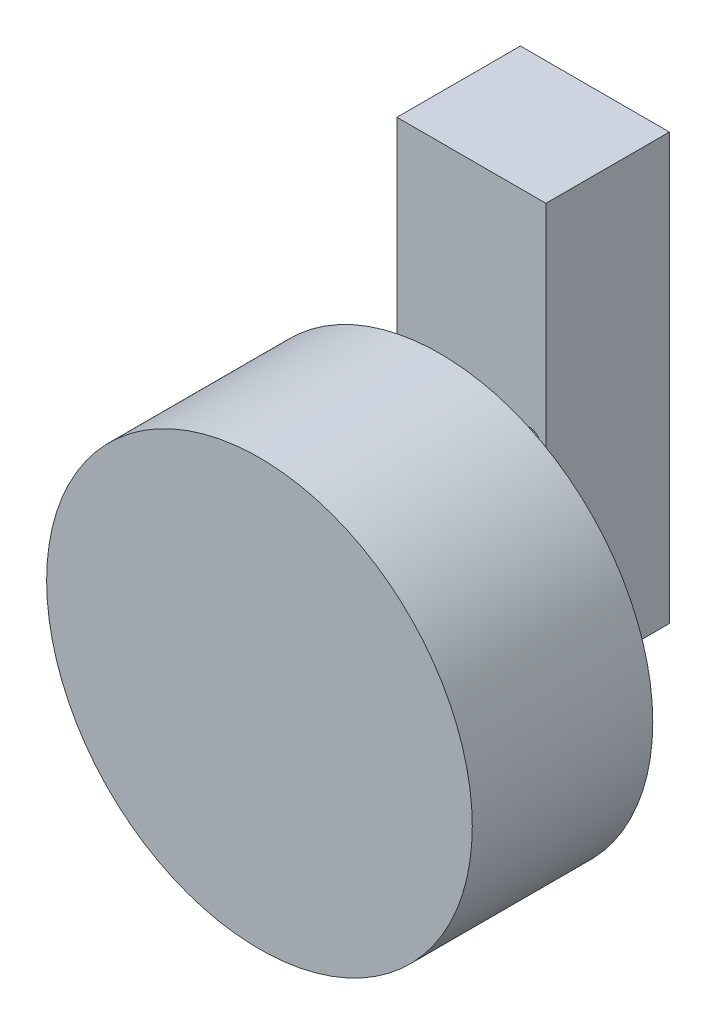
ISO-10303-21;
HEADER;
FILE_DESCRIPTION(('STEP AP214'),'2;1');
FILE_NAME('part.step','',(''),(''),'','','');
FILE_SCHEMA(('AUTOMOTIVE_DESIGN { 1 0 10303 214 1 1 1 1 }'));
ENDSEC;
DATA;
#1=APPLICATION_CONTEXT('core data for automotive mechanical design processes');
#2=APPLICATION_PROTOCOL_DEFINITION('international standard','automotive_design',2000,#1);
#3=PRODUCT_CONTEXT('',#1,'mechanical');
#4=PRODUCT('Part','Part','',(#3));
#5=PRODUCT_RELATED_PRODUCT_CATEGORY('part','',(#4));
#6=PRODUCT_DEFINITION_FORMATION('','',#4);
#7=PRODUCT_DEFINITION_CONTEXT('part definition',#1,'design');
#8=PRODUCT_DEFINITION('design','',#6,#7);
#9=PRODUCT_DEFINITION_SHAPE('','',#8);
#10=(LENGTH_UNIT() NAMED_UNIT(*) SI_UNIT(.MILLI.,.METRE.));
#11=(NAMED_UNIT(*) PLANE_ANGLE_UNIT() SI_UNIT($,.RADIAN.));
#12=(NAMED_UNIT(*) SI_UNIT($,.STERADIAN.) SOLID_ANGLE_UNIT());
#13=UNCERTAINTY_MEASURE_WITH_UNIT(LENGTH_MEASURE(1.E-05),#10,'distance_accuracy_value','');
#14=(GEOMETRIC_REPRESENTATION_CONTEXT(3) GLOBAL_UNCERTAINTY_ASSIGNED_CONTEXT((#13)) GLOBAL_UNIT_ASSIGNED_CONTEXT((#10,
#11,#12)) REPRESENTATION_CONTEXT('',''));
#15=CARTESIAN_POINT('',(0.,0.,0.));
#16=DIRECTION('',(0.,0.,1.));
#17=DIRECTION('',(1.,0.,0.));
#18=AXIS2_PLACEMENT_3D('',#15,#16,#17);
#19=CARTESIAN_POINT('',(0.,0.,18.415));
#20=DIRECTION('',(0.,0.,1.));
#21=DIRECTION('',(1.,0.,0.));
#22=AXIS2_PLACEMENT_3D('',#19,#20,#21);
#23=PLANE('',#22);
#24=CARTESIAN_POINT('',(-12.9695884476535,0.687725631768964,18.415));
#25=DIRECTION('',(0.,0.,1.));
#26=DIRECTION('',(1.,0.,0.));
#27=AXIS2_PLACEMENT_3D('',#24,#25,#26);
#28=CIRCLE('',#27,1.5875);
#29=CARTESIAN_POINT('',(-11.3820884476535,0.687725631768964,18.415));
#30=VERTEX_POINT('',#29);
#31=EDGE_CURVE('E115',#30,#30,#28,.T.);
#32=ORIENTED_EDGE('',*,*,#31,.F.);
#33=EDGE_LOOP('',(#32));
#34=FACE_BOUND('',#33,.T.);
#35=DIRECTION('',(0.,-1.,0.));
#36=VECTOR('',#35,1.);
#37=CARTESIAN_POINT('',(-32.7815884476534,32.437725631769,18.415));
#38=LINE('',#37,#36);
#39=CARTESIAN_POINT('',(-32.7815884476534,32.437725631769,18.415));
#40=VERTEX_POINT('',#39);
#41=CARTESIAN_POINT('',(-32.7815884476534,-31.062274368231,18.415));
#42=VERTEX_POINT('',#41);
#43=EDGE_CURVE('E85',#40,#42,#38,.T.);
#44=ORIENTED_EDGE('',*,*,#43,.T.);
#45=DIRECTION('',(1.,0.,0.));
#46=VECTOR('',#45,1.);
#47=CARTESIAN_POINT('',(-32.7815884476534,-31.062274368231,18.415));
#48=LINE('',#47,#46);
#49=CARTESIAN_POINT('',(-10.5565884476534,-31.062274368231,18.415));
#50=VERTEX_POINT('',#49);
#51=EDGE_CURVE('E80',#42,#50,#48,.T.);
#52=ORIENTED_EDGE('',*,*,#51,.T.);
#53=DIRECTION('',(0.,1.,0.));
#54=VECTOR('',#53,1.);
#55=CARTESIAN_POINT('',(-10.5565884476534,32.437725631769,18.415));
#56=LINE('',#55,#54);
#57=CARTESIAN_POINT('',(-10.5565884476534,32.437725631769,18.415));
#58=VERTEX_POINT('',#57);
#59=EDGE_CURVE('E83',#50,#58,#56,.T.);
#60=ORIENTED_EDGE('',*,*,#59,.T.);
#61=DIRECTION('',(-1.,0.,0.));
#62=VECTOR('',#61,1.);
#63=CARTESIAN_POINT('',(-32.7815884476534,32.437725631769,18.415));
#64=LINE('',#63,#62);
#65=EDGE_CURVE('E50',#58,#40,#64,.T.);
#66=ORIENTED_EDGE('',*,*,#65,.T.);
#67=EDGE_LOOP('',(#44,#52,#60,#66));
#68=FACE_BOUND('',#67,.T.);
#69=CARTESIAN_POINT('',(-30.3685884476535,0.68772563176896,18.415));
#70=DIRECTION('',(0.,0.,1.));
#71=DIRECTION('',(1.,0.,0.));
#72=AXIS2_PLACEMENT_3D('',#69,#70,#71);
#73=CIRCLE('',#72,1.5875);
#74=CARTESIAN_POINT('',(-28.7810884476535,0.68772563176896,18.415));
#75=VERTEX_POINT('',#74);
#76=EDGE_CURVE('E100',#75,#75,#73,.T.);
#77=ORIENTED_EDGE('',*,*,#76,.F.);
#78=EDGE_LOOP('',(#77));
#79=FACE_BOUND('',#78,.T.);
#80=CARTESIAN_POINT('',(-21.6690884476534,-21.918274368231,18.415));
#81=DIRECTION('',(0.,0.,1.));
#82=DIRECTION('',(1.,0.,0.));
#83=AXIS2_PLACEMENT_3D('',#80,#81,#82);
#84=CIRCLE('',#83,6.985);
#85=CARTESIAN_POINT('',(-14.6840884476534,-21.918274368231,18.415));
#86=VERTEX_POINT('',#85);
#87=EDGE_CURVE('E124',#86,#86,#84,.T.);
#88=ORIENTED_EDGE('',*,*,#87,.F.);
#89=EDGE_LOOP('',(#88));
#90=FACE_BOUND('',#89,.T.);
#91=ADVANCED_FACE('F33',(#34,#68,#79,#90),#23,.T.);
#92=CARTESIAN_POINT('',(0.,0.,0.));
#93=DIRECTION('',(0.,0.,1.));
#94=DIRECTION('',(1.,0.,0.));
#95=AXIS2_PLACEMENT_3D('',#92,#93,#94);
#96=PLANE('',#95);
#97=CARTESIAN_POINT('',(-30.3685884476535,0.68772563176896,0.));
#98=DIRECTION('',(0.,0.,1.));
#99=DIRECTION('',(1.,0.,0.));
#100=AXIS2_PLACEMENT_3D('',#97,#98,#99);
#101=CIRCLE('',#100,1.5875);
#102=CARTESIAN_POINT('',(-28.7810884476535,0.68772563176896,0.));
#103=VERTEX_POINT('',#102);
#104=EDGE_CURVE('E112',#103,#103,#101,.T.);
#105=ORIENTED_EDGE('',*,*,#104,.T.);
#106=EDGE_LOOP('',(#105));
#107=FACE_BOUND('',#106,.T.);
#108=DIRECTION('',(0.,-1.,0.));
#109=VECTOR('',#108,1.);
#110=CARTESIAN_POINT('',(-32.7815884476534,32.437725631769,0.));
#111=LINE('',#110,#109);
#112=CARTESIAN_POINT('',(-32.7815884476534,32.437725631769,0.));
#113=VERTEX_POINT('',#112);
#114=CARTESIAN_POINT('',(-32.7815884476534,-31.062274368231,0.));
#115=VERTEX_POINT('',#114);
#116=EDGE_CURVE('E97',#113,#115,#111,.T.);
#117=ORIENTED_EDGE('',*,*,#116,.F.);
#118=DIRECTION('',(-1.,0.,0.));
#119=VECTOR('',#118,1.);
#120=CARTESIAN_POINT('',(-32.7815884476534,32.437725631769,0.));
#121=LINE('',#120,#119);
#122=CARTESIAN_POINT('',(-10.5565884476534,32.437725631769,0.));
#123=VERTEX_POINT('',#122);
#124=EDGE_CURVE('E73',#123,#113,#121,.T.);
#125=ORIENTED_EDGE('',*,*,#124,.F.);
#126=DIRECTION('',(0.,1.,0.));
#127=VECTOR('',#126,1.);
#128=CARTESIAN_POINT('',(-10.5565884476534,32.437725631769,0.));
#129=LINE('',#128,#127);
#130=CARTESIAN_POINT('',(-10.5565884476534,-31.062274368231,0.));
#131=VERTEX_POINT('',#130);
#132=EDGE_CURVE('E67',#131,#123,#129,.T.);
#133=ORIENTED_EDGE('',*,*,#132,.F.);
#134=DIRECTION('',(1.,0.,0.));
#135=VECTOR('',#134,1.);
#136=CARTESIAN_POINT('',(-32.7815884476534,-31.062274368231,0.));
#137=LINE('',#136,#135);
#138=EDGE_CURVE('E89',#115,#131,#137,.T.);
#139=ORIENTED_EDGE('',*,*,#138,.F.);
#140=EDGE_LOOP('',(#117,#125,#133,#139));
#141=FACE_BOUND('',#140,.T.);
#142=CARTESIAN_POINT('',(-12.9695884476535,0.687725631768964,0.));
#143=DIRECTION('',(0.,0.,1.));
#144=DIRECTION('',(1.,0.,0.));
#145=AXIS2_PLACEMENT_3D('',#142,#143,#144);
#146=CIRCLE('',#145,1.5875);
#147=CARTESIAN_POINT('',(-11.3820884476535,0.687725631768964,0.));
#148=VERTEX_POINT('',#147);
#149=EDGE_CURVE('E118',#148,#148,#146,.T.);
#150=ORIENTED_EDGE('',*,*,#149,.T.);
#151=EDGE_LOOP('',(#150));
#152=FACE_BOUND('',#151,.T.);
#153=ADVANCED_FACE('F108',(#107,#141,#152),#96,.F.);
#154=CARTESIAN_POINT('',(-32.7815884476534,32.437725631769,18.415));
#155=DIRECTION('',(1.,0.,0.));
#156=DIRECTION('',(0.,0.,-1.));
#157=AXIS2_PLACEMENT_3D('',#154,#155,#156);
#158=PLANE('',#157);
#159=ORIENTED_EDGE('',*,*,#116,.T.);
#160=DIRECTION('',(0.,0.,-1.));
#161=VECTOR('',#160,1.);
#162=CARTESIAN_POINT('',(-32.7815884476534,-31.062274368231,18.415));
#163=LINE('',#162,#161);
#164=EDGE_CURVE('E11',#42,#115,#163,.T.);
#165=ORIENTED_EDGE('',*,*,#164,.F.);
#166=ORIENTED_EDGE('',*,*,#43,.F.);
#167=DIRECTION('',(0.,0.,-1.));
#168=VECTOR('',#167,1.);
#169=CARTESIAN_POINT('',(-32.7815884476534,32.437725631769,18.415));
#170=LINE('',#169,#168);
#171=EDGE_CURVE('E93',#40,#113,#170,.T.);
#172=ORIENTED_EDGE('',*,*,#171,.T.);
#173=EDGE_LOOP('',(#159,#165,#166,#172));
#174=FACE_BOUND('',#173,.T.);
#175=ADVANCED_FACE('F35',(#174),#158,.F.);
#176=CARTESIAN_POINT('',(-32.7815884476534,-31.062274368231,18.415));
#177=DIRECTION('',(0.,1.,0.));
#178=DIRECTION('',(-1.,0.,0.));
#179=AXIS2_PLACEMENT_3D('',#176,#177,#178);
#180=PLANE('',#179);
#181=ORIENTED_EDGE('',*,*,#138,.T.);
#182=DIRECTION('',(0.,0.,-1.));
#183=VECTOR('',#182,1.);
#184=CARTESIAN_POINT('',(-10.5565884476534,-31.062274368231,18.415));
#185=LINE('',#184,#183);
#186=EDGE_CURVE('E42',#50,#131,#185,.T.);
#187=ORIENTED_EDGE('',*,*,#186,.F.);
#188=ORIENTED_EDGE('',*,*,#51,.F.);
#189=ORIENTED_EDGE('',*,*,#164,.T.);
#190=EDGE_LOOP('',(#181,#187,#188,#189));
#191=FACE_BOUND('',#190,.T.);
#192=ADVANCED_FACE('F88',(#191),#180,.F.);
#193=CARTESIAN_POINT('',(-10.5565884476534,32.437725631769,18.415));
#194=DIRECTION('',(-1.,0.,0.));
#195=DIRECTION('',(0.,-1.,0.));
#196=AXIS2_PLACEMENT_3D('',#193,#194,#195);
#197=PLANE('',#196);
#198=ORIENTED_EDGE('',*,*,#132,.T.);
#199=DIRECTION('',(0.,0.,-1.));
#200=VECTOR('',#199,1.);
#201=CARTESIAN_POINT('',(-10.5565884476534,32.437725631769,18.415));
#202=LINE('',#201,#200);
#203=EDGE_CURVE('E90',#58,#123,#202,.T.);
#204=ORIENTED_EDGE('',*,*,#203,.F.);
#205=ORIENTED_EDGE('',*,*,#59,.F.);
#206=ORIENTED_EDGE('',*,*,#186,.T.);
#207=EDGE_LOOP('',(#198,#204,#205,#206));
#208=FACE_BOUND('',#207,.T.);
#209=ADVANCED_FACE('F91',(#208),#197,.F.);
#210=CARTESIAN_POINT('',(-32.7815884476534,32.437725631769,18.415));
#211=DIRECTION('',(0.,-1.,0.));
#212=DIRECTION('',(0.,0.,-1.));
#213=AXIS2_PLACEMENT_3D('',#210,#211,#212);
#214=PLANE('',#213);
#215=ORIENTED_EDGE('',*,*,#124,.T.);
#216=ORIENTED_EDGE('',*,*,#171,.F.);
#217=ORIENTED_EDGE('',*,*,#65,.F.);
#218=ORIENTED_EDGE('',*,*,#203,.T.);
#219=EDGE_LOOP('',(#215,#216,#217,#218));
#220=FACE_BOUND('',#219,.T.);
#221=ADVANCED_FACE('F105',(#220),#214,.F.);
#222=CARTESIAN_POINT('',(-30.3685884476535,0.68772563176896,18.415));
#223=DIRECTION('',(0.,0.,-1.));
#224=DIRECTION('',(-1.,0.,0.));
#225=AXIS2_PLACEMENT_3D('',#222,#223,#224);
#226=CYLINDRICAL_SURFACE('',#225,1.5875);
#227=ORIENTED_EDGE('',*,*,#76,.T.);
#228=EDGE_LOOP('',(#227));
#229=FACE_BOUND('',#228,.T.);
#230=ORIENTED_EDGE('',*,*,#104,.F.);
#231=EDGE_LOOP('',(#230));
#232=FACE_BOUND('',#231,.T.);
#233=ADVANCED_FACE('F167',(#229,#232),#226,.F.);
#234=CARTESIAN_POINT('',(-12.9695884476535,0.687725631768964,18.415));
#235=DIRECTION('',(0.,0.,-1.));
#236=DIRECTION('',(-1.,0.,0.));
#237=AXIS2_PLACEMENT_3D('',#234,#235,#236);
#238=CYLINDRICAL_SURFACE('',#237,1.5875);
#239=ORIENTED_EDGE('',*,*,#31,.T.);
#240=EDGE_LOOP('',(#239));
#241=FACE_BOUND('',#240,.T.);
#242=ORIENTED_EDGE('',*,*,#149,.F.);
#243=EDGE_LOOP('',(#242));
#244=FACE_BOUND('',#243,.T.);
#245=ADVANCED_FACE('F153',(#241,#244),#238,.F.);
#246=CARTESIAN_POINT('',(-21.6690884476534,-21.918274368231,23.114));
#247=DIRECTION('',(0.,0.,-1.));
#248=DIRECTION('',(-1.,0.,0.));
#249=AXIS2_PLACEMENT_3D('',#246,#247,#248);
#250=CYLINDRICAL_SURFACE('',#249,6.985);
#251=CARTESIAN_POINT('',(-21.6690884476534,-21.918274368231,23.114));
#252=DIRECTION('',(0.,0.,1.));
#253=DIRECTION('',(1.,0.,0.));
#254=AXIS2_PLACEMENT_3D('',#251,#252,#253);
#255=CIRCLE('',#254,6.985);
#256=CARTESIAN_POINT('',(-14.6840884476534,-21.918274368231,23.114));
#257=VERTEX_POINT('',#256);
#258=EDGE_CURVE('E121',#257,#257,#255,.T.);
#259=ORIENTED_EDGE('',*,*,#258,.F.);
#260=EDGE_LOOP('',(#259));
#261=FACE_BOUND('',#260,.T.);
#262=ORIENTED_EDGE('',*,*,#87,.T.);
#263=EDGE_LOOP('',(#262));
#264=FACE_BOUND('',#263,.T.);
#265=ADVANCED_FACE('F147',(#261,#264),#250,.T.);
#266=CARTESIAN_POINT('',(-21.6690884476534,-21.918274368231,23.114));
#267=DIRECTION('',(0.,0.,1.));
#268=DIRECTION('',(1.,0.,0.));
#269=AXIS2_PLACEMENT_3D('',#266,#267,#268);
#270=PLANE('',#269);
#271=CARTESIAN_POINT('',(-21.6690884476534,-21.918274368231,23.114));
#272=DIRECTION('',(0.,0.,1.));
#273=DIRECTION('',(1.,0.,0.));
#274=AXIS2_PLACEMENT_3D('',#271,#272,#273);
#275=CIRCLE('',#274,31.75);
#276=CARTESIAN_POINT('',(10.0809115523466,-21.918274368231,23.114));
#277=VERTEX_POINT('',#276);
#278=EDGE_CURVE('E130',#277,#277,#275,.T.);
#279=ORIENTED_EDGE('',*,*,#278,.F.);
#280=EDGE_LOOP('',(#279));
#281=FACE_BOUND('',#280,.T.);
#282=ORIENTED_EDGE('',*,*,#258,.T.);
#283=EDGE_LOOP('',(#282));
#284=FACE_BOUND('',#283,.T.);
#285=ADVANCED_FACE('F141',(#281,#284),#270,.F.);
#286=CARTESIAN_POINT('',(-21.6690884476534,-21.918274368231,50.038));
#287=DIRECTION('',(0.,0.,-1.));
#288=DIRECTION('',(-1.,0.,0.));
#289=AXIS2_PLACEMENT_3D('',#286,#287,#288);
#290=CYLINDRICAL_SURFACE('',#289,31.75);
#291=CARTESIAN_POINT('',(-21.6690884476534,-21.918274368231,50.038));
#292=DIRECTION('',(0.,0.,1.));
#293=DIRECTION('',(1.,0.,0.));
#294=AXIS2_PLACEMENT_3D('',#291,#292,#293);
#295=CIRCLE('',#294,31.75);
#296=CARTESIAN_POINT('',(10.0809115523466,-21.918274368231,50.038));
#297=VERTEX_POINT('',#296);
#298=EDGE_CURVE('E127',#297,#297,#295,.T.);
#299=ORIENTED_EDGE('',*,*,#298,.F.);
#300=EDGE_LOOP('',(#299));
#301=FACE_BOUND('',#300,.T.);
#302=ORIENTED_EDGE('',*,*,#278,.T.);
#303=EDGE_LOOP('',(#302));
#304=FACE_BOUND('',#303,.T.);
#305=ADVANCED_FACE('F138',(#301,#304),#290,.T.);
#306=CARTESIAN_POINT('',(-21.6690884476534,-21.918274368231,50.038));
#307=DIRECTION('',(0.,0.,1.));
#308=DIRECTION('',(1.,0.,0.));
#309=AXIS2_PLACEMENT_3D('',#306,#307,#308);
#310=PLANE('',#309);
#311=ORIENTED_EDGE('',*,*,#298,.T.);
#312=EDGE_LOOP('',(#311));
#313=FACE_BOUND('',#312,.T.);
#314=ADVANCED_FACE('F136',(#313),#310,.T.);
#315=CLOSED_SHELL('',(#91,#153,#175,#192,#209,#221,#233,#245,#265,#285,#305,#314));
#316=MANIFOLD_SOLID_BREP('B2',#315);
#317=ADVANCED_BREP_SHAPE_REPRESENTATION('',(#18,#316),#14);
#318=SHAPE_DEFINITION_REPRESENTATION(#9,#317);
ENDSEC;
END-ISO-10303-21;
